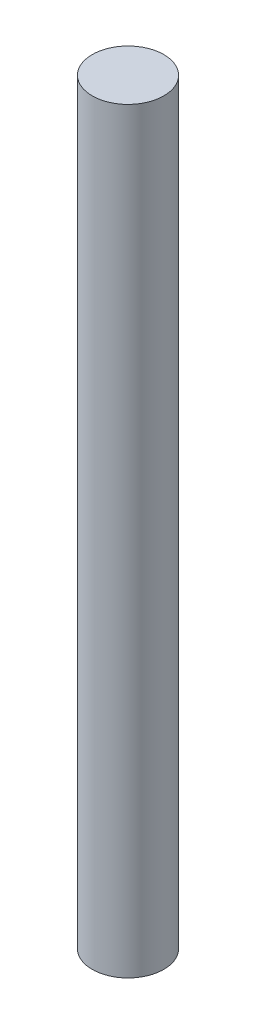
ISO-10303-21;
HEADER;
FILE_DESCRIPTION(('STEP AP214'),'2;1');
FILE_NAME('part.step','',(''),(''),'','','');
FILE_SCHEMA(('AUTOMOTIVE_DESIGN { 1 0 10303 214 1 1 1 1 }'));
ENDSEC;
DATA;
#1=APPLICATION_CONTEXT('core data for automotive mechanical design processes');
#2=APPLICATION_PROTOCOL_DEFINITION('international standard','automotive_design',2000,#1);
#3=PRODUCT_CONTEXT('',#1,'mechanical');
#4=PRODUCT('Part','Part','',(#3));
#5=PRODUCT_RELATED_PRODUCT_CATEGORY('part','',(#4));
#6=PRODUCT_DEFINITION_FORMATION('','',#4);
#7=PRODUCT_DEFINITION_CONTEXT('part definition',#1,'design');
#8=PRODUCT_DEFINITION('design','',#6,#7);
#9=PRODUCT_DEFINITION_SHAPE('','',#8);
#10=(LENGTH_UNIT() NAMED_UNIT(*) SI_UNIT(.MILLI.,.METRE.));
#11=(NAMED_UNIT(*) PLANE_ANGLE_UNIT() SI_UNIT($,.RADIAN.));
#12=(NAMED_UNIT(*) SI_UNIT($,.STERADIAN.) SOLID_ANGLE_UNIT());
#13=UNCERTAINTY_MEASURE_WITH_UNIT(LENGTH_MEASURE(1.E-05),#10,'distance_accuracy_value','');
#14=(GEOMETRIC_REPRESENTATION_CONTEXT(3) GLOBAL_UNCERTAINTY_ASSIGNED_CONTEXT((#13)) GLOBAL_UNIT_ASSIGNED_CONTEXT((#10,
#11,#12)) REPRESENTATION_CONTEXT('',''));
#15=CARTESIAN_POINT('',(0.,0.,0.));
#16=DIRECTION('',(0.,0.,1.));
#17=DIRECTION('',(1.,0.,0.));
#18=AXIS2_PLACEMENT_3D('',#15,#16,#17);
#19=CARTESIAN_POINT('',(0.,0.64,0.));
#20=DIRECTION('',(0.,1.,0.));
#21=DIRECTION('',(0.,0.,1.));
#22=AXIS2_PLACEMENT_3D('',#19,#20,#21);
#23=PLANE('',#22);
#24=CARTESIAN_POINT('',(-2.54,0.64,2.87));
#25=DIRECTION('',(0.,-1.,0.));
#26=DIRECTION('',(0.,0.,-1.));
#27=AXIS2_PLACEMENT_3D('',#24,#25,#26);
#28=CIRCLE('',#27,0.255);
#29=CARTESIAN_POINT('',(-2.54,0.64,2.615));
#30=VERTEX_POINT('',#29);
#31=EDGE_CURVE('E18',#30,#30,#28,.T.);
#32=ORIENTED_EDGE('',*,*,#31,.F.);
#33=EDGE_LOOP('',(#32));
#34=FACE_BOUND('',#33,.T.);
#35=ADVANCED_FACE('F15',(#34),#23,.T.);
#36=CARTESIAN_POINT('',(-2.54,-4.75,2.87));
#37=DIRECTION('',(0.,1.,0.));
#38=DIRECTION('',(0.,0.,1.));
#39=AXIS2_PLACEMENT_3D('',#36,#37,#38);
#40=PLANE('',#39);
#41=CARTESIAN_POINT('',(-2.54,-4.75,2.87));
#42=DIRECTION('',(0.,-1.,0.));
#43=DIRECTION('',(0.,0.,-1.));
#44=AXIS2_PLACEMENT_3D('',#41,#42,#43);
#45=CIRCLE('',#44,0.255);
#46=CARTESIAN_POINT('',(-2.54,-4.75,2.615));
#47=VERTEX_POINT('',#46);
#48=EDGE_CURVE('E10',#47,#47,#45,.F.);
#49=ORIENTED_EDGE('',*,*,#48,.F.);
#50=EDGE_LOOP('',(#49));
#51=FACE_BOUND('',#50,.T.);
#52=ADVANCED_FACE('F30',(#51),#40,.F.);
#53=CARTESIAN_POINT('',(-2.54,1.36124891681,2.87));
#54=DIRECTION('',(0.,-1.,0.));
#55=DIRECTION('',(0.,0.,-1.));
#56=AXIS2_PLACEMENT_3D('',#53,#54,#55);
#57=CYLINDRICAL_SURFACE('',#56,0.255);
#58=ORIENTED_EDGE('',*,*,#48,.T.);
#59=EDGE_LOOP('',(#58));
#60=FACE_BOUND('',#59,.T.);
#61=ORIENTED_EDGE('',*,*,#31,.T.);
#62=EDGE_LOOP('',(#61));
#63=FACE_BOUND('',#62,.T.);
#64=ADVANCED_FACE('F27',(#60,#63),#57,.T.);
#65=CLOSED_SHELL('',(#35,#52,#64));
#66=MANIFOLD_SOLID_BREP('B1',#65);
#67=ADVANCED_BREP_SHAPE_REPRESENTATION('',(#18,#66),#14);
#68=SHAPE_DEFINITION_REPRESENTATION(#9,#67);
ENDSEC;
END-ISO-10303-21;
